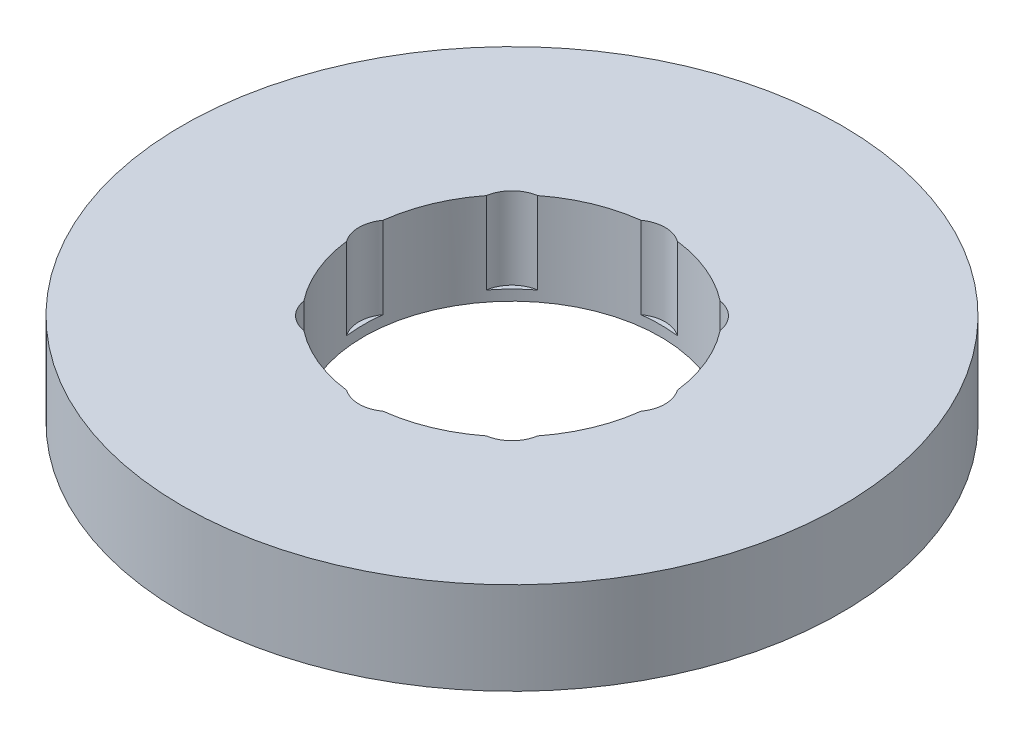
ISO-10303-21;
HEADER;
FILE_DESCRIPTION(('STEP AP214'),'2;1');
FILE_NAME('part.step','',(''),(''),'','','');
FILE_SCHEMA(('AUTOMOTIVE_DESIGN { 1 0 10303 214 1 1 1 1 }'));
ENDSEC;
DATA;
#1=APPLICATION_CONTEXT('core data for automotive mechanical design processes');
#2=APPLICATION_PROTOCOL_DEFINITION('international standard','automotive_design',2000,#1);
#3=PRODUCT_CONTEXT('',#1,'mechanical');
#4=PRODUCT('Part','Part','',(#3));
#5=PRODUCT_RELATED_PRODUCT_CATEGORY('part','',(#4));
#6=PRODUCT_DEFINITION_FORMATION('','',#4);
#7=PRODUCT_DEFINITION_CONTEXT('part definition',#1,'design');
#8=PRODUCT_DEFINITION('design','',#6,#7);
#9=PRODUCT_DEFINITION_SHAPE('','',#8);
#10=(LENGTH_UNIT() NAMED_UNIT(*) SI_UNIT(.MILLI.,.METRE.));
#11=(NAMED_UNIT(*) PLANE_ANGLE_UNIT() SI_UNIT($,.RADIAN.));
#12=(NAMED_UNIT(*) SI_UNIT($,.STERADIAN.) SOLID_ANGLE_UNIT());
#13=UNCERTAINTY_MEASURE_WITH_UNIT(LENGTH_MEASURE(1.E-05),#10,'distance_accuracy_value','');
#14=(GEOMETRIC_REPRESENTATION_CONTEXT(3) GLOBAL_UNCERTAINTY_ASSIGNED_CONTEXT((#13)) GLOBAL_UNIT_ASSIGNED_CONTEXT((#10,
#11,#12)) REPRESENTATION_CONTEXT('',''));
#15=CARTESIAN_POINT('',(0.,0.,0.));
#16=DIRECTION('',(0.,0.,1.));
#17=DIRECTION('',(1.,0.,0.));
#18=AXIS2_PLACEMENT_3D('',#15,#16,#17);
#19=CARTESIAN_POINT('',(0.,28.,0.));
#20=DIRECTION('',(0.,-1.,0.));
#21=DIRECTION('',(0.,0.,-1.));
#22=AXIS2_PLACEMENT_3D('',#19,#20,#21);
#23=CYLINDRICAL_SURFACE('',#22,100.);
#24=CARTESIAN_POINT('',(0.,28.,0.));
#25=DIRECTION('',(0.,1.,0.));
#26=DIRECTION('',(0.,0.,1.));
#27=AXIS2_PLACEMENT_3D('',#24,#25,#26);
#28=CIRCLE('',#27,100.);
#29=CARTESIAN_POINT('',(0.,28.,100.));
#30=VERTEX_POINT('',#29);
#31=EDGE_CURVE('E183',#30,#30,#28,.T.);
#32=ORIENTED_EDGE('',*,*,#31,.F.);
#33=EDGE_LOOP('',(#32));
#34=FACE_BOUND('',#33,.T.);
#35=CARTESIAN_POINT('',(0.,0.,0.));
#36=DIRECTION('',(0.,1.,0.));
#37=DIRECTION('',(0.,0.,1.));
#38=AXIS2_PLACEMENT_3D('',#35,#36,#37);
#39=CIRCLE('',#38,100.);
#40=CARTESIAN_POINT('',(0.,0.,100.));
#41=VERTEX_POINT('',#40);
#42=EDGE_CURVE('E182',#41,#41,#39,.T.);
#43=ORIENTED_EDGE('',*,*,#42,.T.);
#44=EDGE_LOOP('',(#43));
#45=FACE_BOUND('',#44,.T.);
#46=ADVANCED_FACE('F39',(#34,#45),#23,.T.);
#47=CARTESIAN_POINT('',(0.,28.,0.));
#48=DIRECTION('',(0.,1.,0.));
#49=DIRECTION('',(0.,0.,1.));
#50=AXIS2_PLACEMENT_3D('',#47,#48,#49);
#51=PLANE('',#50);
#52=CARTESIAN_POINT('',(1.29324487022736E-13,28.,37.0400052218485));
#53=DIRECTION('',(0.,1.,0.));
#54=DIRECTION('',(1.,0.,0.));
#55=AXIS2_PLACEMENT_3D('',#52,#53,#54);
#56=CIRCLE('',#55,9.40392657882914);
#57=CARTESIAN_POINT('',(-5.50870925722544,28.,44.6615508275223));
#58=VERTEX_POINT('',#57);
#59=CARTESIAN_POINT('',(5.50870925722575,28.,44.6615508275223));
#60=VERTEX_POINT('',#59);
#61=EDGE_CURVE('E256',#58,#60,#56,.T.);
#62=ORIENTED_EDGE('',*,*,#61,.F.);
#63=CARTESIAN_POINT('',(0.,28.,0.));
#64=DIRECTION('',(0.,1.,0.));
#65=DIRECTION('',(0.,0.,1.));
#66=AXIS2_PLACEMENT_3D('',#63,#64,#65);
#67=CIRCLE('',#66,45.);
#68=CARTESIAN_POINT('',(-27.6852397770793,28.,35.4757311198181));
#69=VERTEX_POINT('',#68);
#70=EDGE_CURVE('E175',#69,#58,#67,.T.);
#71=ORIENTED_EDGE('',*,*,#70,.F.);
#72=CARTESIAN_POINT('',(-26.1912388675541,28.,26.1912388675542));
#73=DIRECTION('',(0.,1.,0.));
#74=DIRECTION('',(0.707106781186549,0.,0.707106781186546));
#75=AXIS2_PLACEMENT_3D('',#72,#73,#74);
#76=CIRCLE('',#75,9.40392657882914);
#77=CARTESIAN_POINT('',(-35.475731119818,28.,27.6852397770794));
#78=VERTEX_POINT('',#77);
#79=EDGE_CURVE('E152',#78,#69,#76,.T.);
#80=ORIENTED_EDGE('',*,*,#79,.F.);
#81=CARTESIAN_POINT('',(-44.6615508275223,28.,5.50870925722559));
#82=VERTEX_POINT('',#81);
#83=EDGE_CURVE('E168',#82,#78,#67,.T.);
#84=ORIENTED_EDGE('',*,*,#83,.F.);
#85=CARTESIAN_POINT('',(-37.0400052218485,28.,0.));
#86=DIRECTION('',(0.,1.,0.));
#87=DIRECTION('',(0.,0.,1.));
#88=AXIS2_PLACEMENT_3D('',#85,#86,#87);
#89=CIRCLE('',#88,9.40392657882914);
#90=CARTESIAN_POINT('',(-44.6615508275223,28.,-5.50870925722559));
#91=VERTEX_POINT('',#90);
#92=EDGE_CURVE('E205',#91,#82,#89,.T.);
#93=ORIENTED_EDGE('',*,*,#92,.F.);
#94=CARTESIAN_POINT('',(-35.4757311198183,28.,-27.6852397770789));
#95=VERTEX_POINT('',#94);
#96=EDGE_CURVE('E181',#95,#91,#67,.T.);
#97=ORIENTED_EDGE('',*,*,#96,.F.);
#98=CARTESIAN_POINT('',(-26.1912388675545,28.,-26.1912388675539));
#99=DIRECTION('',(0.,1.,0.));
#100=DIRECTION('',(-0.707106781186539,0.,0.707106781186556));
#101=AXIS2_PLACEMENT_3D('',#98,#99,#100);
#102=CIRCLE('',#101,9.40392657882914);
#103=CARTESIAN_POINT('',(-27.6852397770798,28.,-35.4757311198177));
#104=VERTEX_POINT('',#103);
#105=EDGE_CURVE('E453',#104,#95,#102,.T.);
#106=ORIENTED_EDGE('',*,*,#105,.F.);
#107=CARTESIAN_POINT('',(-5.50870925722606,28.,-44.6615508275222));
#108=VERTEX_POINT('',#107);
#109=EDGE_CURVE('E189',#108,#104,#67,.T.);
#110=ORIENTED_EDGE('',*,*,#109,.F.);
#111=CARTESIAN_POINT('',(-3.87973461068208E-13,28.,-37.0400052218485));
#112=DIRECTION('',(0.,1.,0.));
#113=DIRECTION('',(-1.,0.,0.));
#114=AXIS2_PLACEMENT_3D('',#111,#112,#113);
#115=CIRCLE('',#114,9.40392657882914);
#116=CARTESIAN_POINT('',(5.50870925722513,28.,-44.6615508275223));
#117=VERTEX_POINT('',#116);
#118=EDGE_CURVE('E462',#117,#108,#115,.T.);
#119=ORIENTED_EDGE('',*,*,#118,.F.);
#120=CARTESIAN_POINT('',(27.685239777079,28.,-35.4757311198182));
#121=VERTEX_POINT('',#120);
#122=EDGE_CURVE('E197',#121,#117,#67,.T.);
#123=ORIENTED_EDGE('',*,*,#122,.F.);
#124=CARTESIAN_POINT('',(26.191238867554,28.,-26.1912388675544));
#125=DIRECTION('',(0.,1.,0.));
#126=DIRECTION('',(-0.707106781186554,0.,-0.707106781186541));
#127=AXIS2_PLACEMENT_3D('',#124,#125,#126);
#128=CIRCLE('',#127,9.40392657882914);
#129=CARTESIAN_POINT('',(35.4757311198178,28.,-27.6852397770797));
#130=VERTEX_POINT('',#129);
#131=EDGE_CURVE('E470',#130,#121,#128,.T.);
#132=ORIENTED_EDGE('',*,*,#131,.F.);
#133=CARTESIAN_POINT('',(44.6615508275223,28.,-5.50870925722559));
#134=VERTEX_POINT('',#133);
#135=EDGE_CURVE('E489',#134,#130,#67,.T.);
#136=ORIENTED_EDGE('',*,*,#135,.F.);
#137=CARTESIAN_POINT('',(37.0400052218485,28.,0.));
#138=DIRECTION('',(0.,1.,0.));
#139=DIRECTION('',(0.,0.,-1.));
#140=AXIS2_PLACEMENT_3D('',#137,#138,#139);
#141=CIRCLE('',#140,9.40392657882914);
#142=CARTESIAN_POINT('',(44.6615508275223,28.,5.50870925722559));
#143=VERTEX_POINT('',#142);
#144=EDGE_CURVE('E476',#143,#134,#141,.T.);
#145=ORIENTED_EDGE('',*,*,#144,.F.);
#146=CARTESIAN_POINT('',(35.4757311198181,28.,27.6852397770792));
#147=VERTEX_POINT('',#146);
#148=EDGE_CURVE('E491',#147,#143,#67,.T.);
#149=ORIENTED_EDGE('',*,*,#148,.F.);
#150=CARTESIAN_POINT('',(26.1912388675543,28.,26.191238867554));
#151=DIRECTION('',(0.,1.,0.));
#152=DIRECTION('',(0.707106781186544,0.,-0.707106781186551));
#153=AXIS2_PLACEMENT_3D('',#150,#151,#152);
#154=CIRCLE('',#153,9.40392657882914);
#155=CARTESIAN_POINT('',(27.6852397770795,28.,35.4757311198179));
#156=VERTEX_POINT('',#155);
#157=EDGE_CURVE('E475',#156,#147,#154,.T.);
#158=ORIENTED_EDGE('',*,*,#157,.F.);
#159=EDGE_CURVE('E190',#60,#156,#67,.T.);
#160=ORIENTED_EDGE('',*,*,#159,.F.);
#161=EDGE_LOOP('',(#62,#71,#80,#84,#93,#97,#106,#110,#119,#123,#132,#136,#145,#149,#158,#160));
#162=FACE_BOUND('',#161,.T.);
#163=ORIENTED_EDGE('',*,*,#31,.T.);
#164=EDGE_LOOP('',(#163));
#165=FACE_BOUND('',#164,.T.);
#166=ADVANCED_FACE('F170',(#162,#165),#51,.T.);
#167=CARTESIAN_POINT('',(0.,0.,0.));
#168=DIRECTION('',(0.,1.,0.));
#169=DIRECTION('',(0.,0.,1.));
#170=AXIS2_PLACEMENT_3D('',#167,#168,#169);
#171=PLANE('',#170);
#172=CARTESIAN_POINT('',(0.,0.,0.));
#173=DIRECTION('',(0.,1.,0.));
#174=DIRECTION('',(0.,0.,1.));
#175=AXIS2_PLACEMENT_3D('',#172,#173,#174);
#176=CIRCLE('',#175,45.);
#177=CARTESIAN_POINT('',(0.,0.,45.));
#178=VERTEX_POINT('',#177);
#179=EDGE_CURVE('E191',#178,#178,#176,.T.);
#180=ORIENTED_EDGE('',*,*,#179,.T.);
#181=EDGE_LOOP('',(#180));
#182=FACE_BOUND('',#181,.T.);
#183=ORIENTED_EDGE('',*,*,#42,.F.);
#184=EDGE_LOOP('',(#183));
#185=FACE_BOUND('',#184,.T.);
#186=ADVANCED_FACE('F277',(#182,#185),#171,.F.);
#187=CARTESIAN_POINT('',(0.,28.,0.));
#188=DIRECTION('',(0.,-1.,0.));
#189=DIRECTION('',(0.,0.,-1.));
#190=AXIS2_PLACEMENT_3D('',#187,#188,#189);
#191=CYLINDRICAL_SURFACE('',#190,45.);
#192=DIRECTION('',(0.,1.,0.));
#193=VECTOR('',#192,1.);
#194=CARTESIAN_POINT('',(-5.50870925722543,15.5942397780652,44.6615508275223));
#195=LINE('',#194,#193);
#196=CARTESIAN_POINT('',(-5.50870925722544,3.1884795561304,44.6615508275223));
#197=VERTEX_POINT('',#196);
#198=EDGE_CURVE('E11',#197,#58,#195,.T.);
#199=ORIENTED_EDGE('',*,*,#198,.F.);
#200=CARTESIAN_POINT('',(0.,3.1884795561304,0.));
#201=DIRECTION('',(0.,1.,0.));
#202=DIRECTION('',(0.,0.,1.));
#203=AXIS2_PLACEMENT_3D('',#200,#201,#202);
#204=CIRCLE('',#203,45.);
#205=CARTESIAN_POINT('',(5.50870925722575,3.1884795561304,44.6615508275223));
#206=VERTEX_POINT('',#205);
#207=EDGE_CURVE('E251',#197,#206,#204,.T.);
#208=ORIENTED_EDGE('',*,*,#207,.T.);
#209=DIRECTION('',(0.,1.,0.));
#210=VECTOR('',#209,1.);
#211=CARTESIAN_POINT('',(5.50870925722574,15.5942397780652,44.6615508275223));
#212=LINE('',#211,#210);
#213=EDGE_CURVE('E46',#60,#206,#212,.F.);
#214=ORIENTED_EDGE('',*,*,#213,.F.);
#215=ORIENTED_EDGE('',*,*,#159,.T.);
#216=DIRECTION('',(0.,1.,0.));
#217=VECTOR('',#216,1.);
#218=CARTESIAN_POINT('',(27.6852397770796,15.5942397780652,35.4757311198179));
#219=LINE('',#218,#217);
#220=CARTESIAN_POINT('',(27.6852397770795,3.1884795561304,35.4757311198179));
#221=VERTEX_POINT('',#220);
#222=EDGE_CURVE('E253',#221,#156,#219,.T.);
#223=ORIENTED_EDGE('',*,*,#222,.F.);
#224=CARTESIAN_POINT('',(0.,3.1884795561304,0.));
#225=DIRECTION('',(0.,1.,0.));
#226=DIRECTION('',(0.,0.,1.));
#227=AXIS2_PLACEMENT_3D('',#224,#225,#226);
#228=CIRCLE('',#227,45.);
#229=CARTESIAN_POINT('',(35.4757311198181,3.1884795561304,27.6852397770792));
#230=VERTEX_POINT('',#229);
#231=EDGE_CURVE('E246',#221,#230,#228,.T.);
#232=ORIENTED_EDGE('',*,*,#231,.T.);
#233=DIRECTION('',(0.,1.,0.));
#234=VECTOR('',#233,1.);
#235=CARTESIAN_POINT('',(35.4757311198181,15.5942397780652,27.6852397770792));
#236=LINE('',#235,#234);
#237=EDGE_CURVE('E248',#147,#230,#236,.F.);
#238=ORIENTED_EDGE('',*,*,#237,.F.);
#239=ORIENTED_EDGE('',*,*,#148,.T.);
#240=DIRECTION('',(0.,1.,0.));
#241=VECTOR('',#240,1.);
#242=CARTESIAN_POINT('',(44.6615508275223,15.5942397780652,5.50870925722558));
#243=LINE('',#242,#241);
#244=CARTESIAN_POINT('',(44.6615508275223,3.1884795561304,5.50870925722559));
#245=VERTEX_POINT('',#244);
#246=EDGE_CURVE('E243',#245,#143,#243,.T.);
#247=ORIENTED_EDGE('',*,*,#246,.F.);
#248=CARTESIAN_POINT('',(0.,3.1884795561304,0.));
#249=DIRECTION('',(0.,1.,0.));
#250=DIRECTION('',(0.,0.,1.));
#251=AXIS2_PLACEMENT_3D('',#248,#249,#250);
#252=CIRCLE('',#251,45.);
#253=CARTESIAN_POINT('',(44.6615508275223,3.1884795561304,-5.50870925722559));
#254=VERTEX_POINT('',#253);
#255=EDGE_CURVE('E236',#245,#254,#252,.T.);
#256=ORIENTED_EDGE('',*,*,#255,.T.);
#257=DIRECTION('',(0.,1.,0.));
#258=VECTOR('',#257,1.);
#259=CARTESIAN_POINT('',(44.6615508275223,15.5942397780652,-5.50870925722558));
#260=LINE('',#259,#258);
#261=EDGE_CURVE('E241',#134,#254,#260,.F.);
#262=ORIENTED_EDGE('',*,*,#261,.F.);
#263=ORIENTED_EDGE('',*,*,#135,.T.);
#264=DIRECTION('',(0.,1.,0.));
#265=VECTOR('',#264,1.);
#266=CARTESIAN_POINT('',(35.4757311198178,15.5942397780652,-27.6852397770797));
#267=LINE('',#266,#265);
#268=CARTESIAN_POINT('',(35.4757311198178,3.1884795561304,-27.6852397770797));
#269=VERTEX_POINT('',#268);
#270=EDGE_CURVE('E237',#269,#130,#267,.T.);
#271=ORIENTED_EDGE('',*,*,#270,.F.);
#272=CARTESIAN_POINT('',(0.,3.1884795561304,0.));
#273=DIRECTION('',(0.,1.,0.));
#274=DIRECTION('',(0.,0.,1.));
#275=AXIS2_PLACEMENT_3D('',#272,#273,#274);
#276=CIRCLE('',#275,45.);
#277=CARTESIAN_POINT('',(27.685239777079,3.1884795561304,-35.4757311198182));
#278=VERTEX_POINT('',#277);
#279=EDGE_CURVE('E229',#269,#278,#276,.T.);
#280=ORIENTED_EDGE('',*,*,#279,.T.);
#281=DIRECTION('',(0.,1.,0.));
#282=VECTOR('',#281,1.);
#283=CARTESIAN_POINT('',(27.6852397770791,15.5942397780652,-35.4757311198182));
#284=LINE('',#283,#282);
#285=EDGE_CURVE('E232',#121,#278,#284,.F.);
#286=ORIENTED_EDGE('',*,*,#285,.F.);
#287=ORIENTED_EDGE('',*,*,#122,.T.);
#288=DIRECTION('',(0.,1.,0.));
#289=VECTOR('',#288,1.);
#290=CARTESIAN_POINT('',(5.50870925722512,15.5942397780652,-44.6615508275224));
#291=LINE('',#290,#289);
#292=CARTESIAN_POINT('',(5.50870925722513,3.1884795561304,-44.6615508275223));
#293=VERTEX_POINT('',#292);
#294=EDGE_CURVE('E227',#293,#117,#291,.T.);
#295=ORIENTED_EDGE('',*,*,#294,.F.);
#296=CARTESIAN_POINT('',(0.,3.1884795561304,0.));
#297=DIRECTION('',(0.,1.,0.));
#298=DIRECTION('',(0.,0.,1.));
#299=AXIS2_PLACEMENT_3D('',#296,#297,#298);
#300=CIRCLE('',#299,45.);
#301=CARTESIAN_POINT('',(-5.50870925722606,3.1884795561304,-44.6615508275222));
#302=VERTEX_POINT('',#301);
#303=EDGE_CURVE('E225',#293,#302,#300,.T.);
#304=ORIENTED_EDGE('',*,*,#303,.T.);
#305=DIRECTION('',(0.,1.,0.));
#306=VECTOR('',#305,1.);
#307=CARTESIAN_POINT('',(-5.50870925722605,15.5942397780652,-44.6615508275222));
#308=LINE('',#307,#306);
#309=EDGE_CURVE('E223',#108,#302,#308,.F.);
#310=ORIENTED_EDGE('',*,*,#309,.F.);
#311=ORIENTED_EDGE('',*,*,#109,.T.);
#312=DIRECTION('',(0.,1.,0.));
#313=VECTOR('',#312,1.);
#314=CARTESIAN_POINT('',(-27.6852397770798,15.5942397780652,-35.4757311198177));
#315=LINE('',#314,#313);
#316=CARTESIAN_POINT('',(-27.6852397770798,3.1884795561304,-35.4757311198177));
#317=VERTEX_POINT('',#316);
#318=EDGE_CURVE('E219',#317,#104,#315,.T.);
#319=ORIENTED_EDGE('',*,*,#318,.F.);
#320=CARTESIAN_POINT('',(0.,3.1884795561304,0.));
#321=DIRECTION('',(0.,1.,0.));
#322=DIRECTION('',(0.,0.,1.));
#323=AXIS2_PLACEMENT_3D('',#320,#321,#322);
#324=CIRCLE('',#323,45.);
#325=CARTESIAN_POINT('',(-35.4757311198183,3.1884795561304,-27.6852397770789));
#326=VERTEX_POINT('',#325);
#327=EDGE_CURVE('E159',#317,#326,#324,.T.);
#328=ORIENTED_EDGE('',*,*,#327,.T.);
#329=DIRECTION('',(0.,1.,0.));
#330=VECTOR('',#329,1.);
#331=CARTESIAN_POINT('',(-35.4757311198183,15.5942397780652,-27.6852397770789));
#332=LINE('',#331,#330);
#333=EDGE_CURVE('E220',#95,#326,#332,.F.);
#334=ORIENTED_EDGE('',*,*,#333,.F.);
#335=ORIENTED_EDGE('',*,*,#96,.T.);
#336=DIRECTION('',(0.,1.,0.));
#337=VECTOR('',#336,1.);
#338=CARTESIAN_POINT('',(-44.6615508275223,15.5942397780652,-5.50870925722558));
#339=LINE('',#338,#337);
#340=CARTESIAN_POINT('',(-44.6615508275223,3.1884795561304,-5.50870925722559));
#341=VERTEX_POINT('',#340);
#342=EDGE_CURVE('E209',#341,#91,#339,.T.);
#343=ORIENTED_EDGE('',*,*,#342,.F.);
#344=CARTESIAN_POINT('',(0.,3.1884795561304,0.));
#345=DIRECTION('',(0.,1.,0.));
#346=DIRECTION('',(0.,0.,1.));
#347=AXIS2_PLACEMENT_3D('',#344,#345,#346);
#348=CIRCLE('',#347,45.);
#349=CARTESIAN_POINT('',(-44.6615508275223,3.1884795561304,5.50870925722559));
#350=VERTEX_POINT('',#349);
#351=EDGE_CURVE('E206',#341,#350,#348,.T.);
#352=ORIENTED_EDGE('',*,*,#351,.T.);
#353=DIRECTION('',(0.,1.,0.));
#354=VECTOR('',#353,1.);
#355=CARTESIAN_POINT('',(-44.6615508275223,15.5942397780652,5.50870925722558));
#356=LINE('',#355,#354);
#357=EDGE_CURVE('E179',#82,#350,#356,.F.);
#358=ORIENTED_EDGE('',*,*,#357,.F.);
#359=ORIENTED_EDGE('',*,*,#83,.T.);
#360=DIRECTION('',(0.,1.,0.));
#361=VECTOR('',#360,1.);
#362=CARTESIAN_POINT('',(-35.475731119818,15.5942397780652,27.6852397770794));
#363=LINE('',#362,#361);
#364=CARTESIAN_POINT('',(-35.475731119818,3.1884795561304,27.6852397770794));
#365=VERTEX_POINT('',#364);
#366=EDGE_CURVE('E147',#365,#78,#363,.T.);
#367=ORIENTED_EDGE('',*,*,#366,.F.);
#368=CARTESIAN_POINT('',(0.,3.1884795561304,0.));
#369=DIRECTION('',(0.,1.,0.));
#370=DIRECTION('',(0.,0.,1.));
#371=AXIS2_PLACEMENT_3D('',#368,#369,#370);
#372=CIRCLE('',#371,45.);
#373=CARTESIAN_POINT('',(-27.6852397770793,3.1884795561304,35.4757311198181));
#374=VERTEX_POINT('',#373);
#375=EDGE_CURVE('E215',#365,#374,#372,.T.);
#376=ORIENTED_EDGE('',*,*,#375,.T.);
#377=DIRECTION('',(0.,1.,0.));
#378=VECTOR('',#377,1.);
#379=CARTESIAN_POINT('',(-27.6852397770793,15.5942397780652,35.4757311198181));
#380=LINE('',#379,#378);
#381=EDGE_CURVE('E161',#69,#374,#380,.F.);
#382=ORIENTED_EDGE('',*,*,#381,.F.);
#383=ORIENTED_EDGE('',*,*,#70,.T.);
#384=EDGE_LOOP('',(#199,#208,#214,#215,#223,#232,#238,#239,#247,#256,#262,#263,#271,#280,#286,
#287,#295,#304,#310,#311,#319,#328,#334,#335,#343,#352,#358,#359,#367,#376,#382,#383));
#385=FACE_BOUND('',#384,.T.);
#386=ORIENTED_EDGE('',*,*,#179,.F.);
#387=EDGE_LOOP('',(#386));
#388=FACE_BOUND('',#387,.T.);
#389=ADVANCED_FACE('F176',(#385,#388),#191,.F.);
#390=CARTESIAN_POINT('',(-37.0400052218485,3.1884795561304,0.));
#391=DIRECTION('',(0.,1.,0.));
#392=DIRECTION('',(0.,0.,1.));
#393=AXIS2_PLACEMENT_3D('',#390,#391,#392);
#394=CYLINDRICAL_SURFACE('',#393,9.40392657882914);
#395=ORIENTED_EDGE('',*,*,#342,.T.);
#396=ORIENTED_EDGE('',*,*,#92,.T.);
#397=ORIENTED_EDGE('',*,*,#357,.T.);
#398=CARTESIAN_POINT('',(-37.0400052218485,3.1884795561304,0.));
#399=DIRECTION('',(0.,1.,0.));
#400=DIRECTION('',(0.,0.,1.));
#401=AXIS2_PLACEMENT_3D('',#398,#399,#400);
#402=CIRCLE('',#401,9.40392657882914);
#403=EDGE_CURVE('E200',#341,#350,#402,.T.);
#404=ORIENTED_EDGE('',*,*,#403,.F.);
#405=EDGE_LOOP('',(#395,#396,#397,#404));
#406=FACE_BOUND('',#405,.T.);
#407=ADVANCED_FACE('F286',(#406),#394,.F.);
#408=CARTESIAN_POINT('',(-37.0400052218485,3.1884795561304,0.));
#409=DIRECTION('',(0.,1.,0.));
#410=DIRECTION('',(0.,0.,1.));
#411=AXIS2_PLACEMENT_3D('',#408,#409,#410);
#412=PLANE('',#411);
#413=ORIENTED_EDGE('',*,*,#403,.T.);
#414=ORIENTED_EDGE('',*,*,#351,.F.);
#415=EDGE_LOOP('',(#413,#414));
#416=FACE_BOUND('',#415,.T.);
#417=ADVANCED_FACE('F289',(#416),#412,.T.);
#418=CARTESIAN_POINT('',(-26.1912388675541,3.1884795561304,26.1912388675542));
#419=DIRECTION('',(0.,1.,0.));
#420=DIRECTION('',(0.,0.,1.));
#421=AXIS2_PLACEMENT_3D('',#418,#419,#420);
#422=CYLINDRICAL_SURFACE('',#421,9.40392657882914);
#423=ORIENTED_EDGE('',*,*,#366,.T.);
#424=ORIENTED_EDGE('',*,*,#79,.T.);
#425=ORIENTED_EDGE('',*,*,#381,.T.);
#426=CARTESIAN_POINT('',(-26.1912388675541,3.1884795561304,26.1912388675542));
#427=DIRECTION('',(0.,1.,0.));
#428=DIRECTION('',(0.707106781186549,0.,0.707106781186546));
#429=AXIS2_PLACEMENT_3D('',#426,#427,#428);
#430=CIRCLE('',#429,9.40392657882914);
#431=EDGE_CURVE('E156',#365,#374,#430,.T.);
#432=ORIENTED_EDGE('',*,*,#431,.F.);
#433=EDGE_LOOP('',(#423,#424,#425,#432));
#434=FACE_BOUND('',#433,.T.);
#435=ADVANCED_FACE('F155',(#434),#422,.F.);
#436=CARTESIAN_POINT('',(-26.1912388675541,3.1884795561304,26.1912388675542));
#437=DIRECTION('',(0.,1.,0.));
#438=DIRECTION('',(0.707106781186549,0.,0.707106781186546));
#439=AXIS2_PLACEMENT_3D('',#436,#437,#438);
#440=PLANE('',#439);
#441=ORIENTED_EDGE('',*,*,#431,.T.);
#442=ORIENTED_EDGE('',*,*,#375,.F.);
#443=EDGE_LOOP('',(#441,#442));
#444=FACE_BOUND('',#443,.T.);
#445=ADVANCED_FACE('F300',(#444),#440,.T.);
#446=CARTESIAN_POINT('',(-26.1912388675545,3.1884795561304,-26.1912388675539));
#447=DIRECTION('',(0.,1.,0.));
#448=DIRECTION('',(0.,0.,1.));
#449=AXIS2_PLACEMENT_3D('',#446,#447,#448);
#450=CYLINDRICAL_SURFACE('',#449,9.40392657882914);
#451=ORIENTED_EDGE('',*,*,#318,.T.);
#452=ORIENTED_EDGE('',*,*,#105,.T.);
#453=ORIENTED_EDGE('',*,*,#333,.T.);
#454=CARTESIAN_POINT('',(-26.1912388675545,3.1884795561304,-26.1912388675539));
#455=DIRECTION('',(0.,1.,0.));
#456=DIRECTION('',(-0.707106781186539,0.,0.707106781186556));
#457=AXIS2_PLACEMENT_3D('',#454,#455,#456);
#458=CIRCLE('',#457,9.40392657882914);
#459=EDGE_CURVE('E454',#317,#326,#458,.T.);
#460=ORIENTED_EDGE('',*,*,#459,.F.);
#461=EDGE_LOOP('',(#451,#452,#453,#460));
#462=FACE_BOUND('',#461,.T.);
#463=ADVANCED_FACE('F299',(#462),#450,.F.);
#464=CARTESIAN_POINT('',(-26.1912388675545,3.1884795561304,-26.1912388675539));
#465=DIRECTION('',(0.,1.,0.));
#466=DIRECTION('',(-0.707106781186539,0.,0.707106781186556));
#467=AXIS2_PLACEMENT_3D('',#464,#465,#466);
#468=PLANE('',#467);
#469=ORIENTED_EDGE('',*,*,#459,.T.);
#470=ORIENTED_EDGE('',*,*,#327,.F.);
#471=EDGE_LOOP('',(#469,#470));
#472=FACE_BOUND('',#471,.T.);
#473=ADVANCED_FACE('F379',(#472),#468,.T.);
#474=CARTESIAN_POINT('',(-3.87973461068208E-13,3.1884795561304,-37.0400052218485));
#475=DIRECTION('',(0.,1.,0.));
#476=DIRECTION('',(0.,0.,1.));
#477=AXIS2_PLACEMENT_3D('',#474,#475,#476);
#478=CYLINDRICAL_SURFACE('',#477,9.40392657882914);
#479=ORIENTED_EDGE('',*,*,#294,.T.);
#480=ORIENTED_EDGE('',*,*,#118,.T.);
#481=ORIENTED_EDGE('',*,*,#309,.T.);
#482=CARTESIAN_POINT('',(-3.87973461068208E-13,3.1884795561304,-37.0400052218485));
#483=DIRECTION('',(0.,1.,0.));
#484=DIRECTION('',(-1.,0.,0.));
#485=AXIS2_PLACEMENT_3D('',#482,#483,#484);
#486=CIRCLE('',#485,9.40392657882914);
#487=EDGE_CURVE('E465',#293,#302,#486,.T.);
#488=ORIENTED_EDGE('',*,*,#487,.F.);
#489=EDGE_LOOP('',(#479,#480,#481,#488));
#490=FACE_BOUND('',#489,.T.);
#491=ADVANCED_FACE('F371',(#490),#478,.F.);
#492=CARTESIAN_POINT('',(-3.87973461068208E-13,3.1884795561304,-37.0400052218485));
#493=DIRECTION('',(0.,1.,0.));
#494=DIRECTION('',(-1.,0.,0.));
#495=AXIS2_PLACEMENT_3D('',#492,#493,#494);
#496=PLANE('',#495);
#497=ORIENTED_EDGE('',*,*,#487,.T.);
#498=ORIENTED_EDGE('',*,*,#303,.F.);
#499=EDGE_LOOP('',(#497,#498));
#500=FACE_BOUND('',#499,.T.);
#501=ADVANCED_FACE('F308',(#500),#496,.T.);
#502=CARTESIAN_POINT('',(26.191238867554,3.1884795561304,-26.1912388675544));
#503=DIRECTION('',(0.,1.,0.));
#504=DIRECTION('',(0.,0.,1.));
#505=AXIS2_PLACEMENT_3D('',#502,#503,#504);
#506=CYLINDRICAL_SURFACE('',#505,9.40392657882914);
#507=ORIENTED_EDGE('',*,*,#270,.T.);
#508=ORIENTED_EDGE('',*,*,#131,.T.);
#509=ORIENTED_EDGE('',*,*,#285,.T.);
#510=CARTESIAN_POINT('',(26.191238867554,3.1884795561304,-26.1912388675544));
#511=DIRECTION('',(0.,1.,0.));
#512=DIRECTION('',(-0.707106781186554,0.,-0.707106781186541));
#513=AXIS2_PLACEMENT_3D('',#510,#511,#512);
#514=CIRCLE('',#513,9.40392657882914);
#515=EDGE_CURVE('E477',#269,#278,#514,.T.);
#516=ORIENTED_EDGE('',*,*,#515,.F.);
#517=EDGE_LOOP('',(#507,#508,#509,#516));
#518=FACE_BOUND('',#517,.T.);
#519=ADVANCED_FACE('F305',(#518),#506,.F.);
#520=CARTESIAN_POINT('',(26.191238867554,3.1884795561304,-26.1912388675544));
#521=DIRECTION('',(0.,1.,0.));
#522=DIRECTION('',(-0.707106781186554,0.,-0.707106781186541));
#523=AXIS2_PLACEMENT_3D('',#520,#521,#522);
#524=PLANE('',#523);
#525=ORIENTED_EDGE('',*,*,#515,.T.);
#526=ORIENTED_EDGE('',*,*,#279,.F.);
#527=EDGE_LOOP('',(#525,#526));
#528=FACE_BOUND('',#527,.T.);
#529=ADVANCED_FACE('F304',(#528),#524,.T.);
#530=CARTESIAN_POINT('',(37.0400052218485,3.1884795561304,0.));
#531=DIRECTION('',(0.,1.,0.));
#532=DIRECTION('',(0.,0.,1.));
#533=AXIS2_PLACEMENT_3D('',#530,#531,#532);
#534=CYLINDRICAL_SURFACE('',#533,9.40392657882914);
#535=ORIENTED_EDGE('',*,*,#246,.T.);
#536=ORIENTED_EDGE('',*,*,#144,.T.);
#537=ORIENTED_EDGE('',*,*,#261,.T.);
#538=CARTESIAN_POINT('',(37.0400052218485,3.1884795561304,0.));
#539=DIRECTION('',(0.,1.,0.));
#540=DIRECTION('',(0.,0.,-1.));
#541=AXIS2_PLACEMENT_3D('',#538,#539,#540);
#542=CIRCLE('',#541,9.40392657882914);
#543=EDGE_CURVE('E478',#245,#254,#542,.T.);
#544=ORIENTED_EDGE('',*,*,#543,.F.);
#545=EDGE_LOOP('',(#535,#536,#537,#544));
#546=FACE_BOUND('',#545,.T.);
#547=ADVANCED_FACE('F309',(#546),#534,.F.);
#548=CARTESIAN_POINT('',(37.0400052218485,3.1884795561304,0.));
#549=DIRECTION('',(0.,1.,0.));
#550=DIRECTION('',(0.,0.,-1.));
#551=AXIS2_PLACEMENT_3D('',#548,#549,#550);
#552=PLANE('',#551);
#553=ORIENTED_EDGE('',*,*,#543,.T.);
#554=ORIENTED_EDGE('',*,*,#255,.F.);
#555=EDGE_LOOP('',(#553,#554));
#556=FACE_BOUND('',#555,.T.);
#557=ADVANCED_FACE('F314',(#556),#552,.T.);
#558=CARTESIAN_POINT('',(26.1912388675543,3.1884795561304,26.191238867554));
#559=DIRECTION('',(0.,1.,0.));
#560=DIRECTION('',(0.,0.,1.));
#561=AXIS2_PLACEMENT_3D('',#558,#559,#560);
#562=CYLINDRICAL_SURFACE('',#561,9.40392657882914);
#563=ORIENTED_EDGE('',*,*,#222,.T.);
#564=ORIENTED_EDGE('',*,*,#157,.T.);
#565=ORIENTED_EDGE('',*,*,#237,.T.);
#566=CARTESIAN_POINT('',(26.1912388675543,3.1884795561304,26.191238867554));
#567=DIRECTION('',(0.,1.,0.));
#568=DIRECTION('',(0.707106781186544,0.,-0.707106781186551));
#569=AXIS2_PLACEMENT_3D('',#566,#567,#568);
#570=CIRCLE('',#569,9.40392657882914);
#571=EDGE_CURVE('E56',#221,#230,#570,.T.);
#572=ORIENTED_EDGE('',*,*,#571,.F.);
#573=EDGE_LOOP('',(#563,#564,#565,#572));
#574=FACE_BOUND('',#573,.T.);
#575=ADVANCED_FACE('F318',(#574),#562,.F.);
#576=CARTESIAN_POINT('',(26.1912388675543,3.1884795561304,26.191238867554));
#577=DIRECTION('',(0.,1.,0.));
#578=DIRECTION('',(0.707106781186544,0.,-0.707106781186551));
#579=AXIS2_PLACEMENT_3D('',#576,#577,#578);
#580=PLANE('',#579);
#581=ORIENTED_EDGE('',*,*,#571,.T.);
#582=ORIENTED_EDGE('',*,*,#231,.F.);
#583=EDGE_LOOP('',(#581,#582));
#584=FACE_BOUND('',#583,.T.);
#585=ADVANCED_FACE('F270',(#584),#580,.T.);
#586=CARTESIAN_POINT('',(1.29324487022736E-13,3.1884795561304,37.0400052218485));
#587=DIRECTION('',(0.,1.,0.));
#588=DIRECTION('',(0.,0.,1.));
#589=AXIS2_PLACEMENT_3D('',#586,#587,#588);
#590=CYLINDRICAL_SURFACE('',#589,9.40392657882914);
#591=ORIENTED_EDGE('',*,*,#198,.T.);
#592=ORIENTED_EDGE('',*,*,#61,.T.);
#593=ORIENTED_EDGE('',*,*,#213,.T.);
#594=CARTESIAN_POINT('',(1.29324487022736E-13,3.1884795561304,37.0400052218485));
#595=DIRECTION('',(0.,1.,0.));
#596=DIRECTION('',(1.,0.,0.));
#597=AXIS2_PLACEMENT_3D('',#594,#595,#596);
#598=CIRCLE('',#597,9.40392657882914);
#599=EDGE_CURVE('E55',#197,#206,#598,.T.);
#600=ORIENTED_EDGE('',*,*,#599,.F.);
#601=EDGE_LOOP('',(#591,#592,#593,#600));
#602=FACE_BOUND('',#601,.T.);
#603=ADVANCED_FACE('F260',(#602),#590,.F.);
#604=CARTESIAN_POINT('',(1.29324487022736E-13,3.1884795561304,37.0400052218485));
#605=DIRECTION('',(0.,1.,0.));
#606=DIRECTION('',(1.,0.,0.));
#607=AXIS2_PLACEMENT_3D('',#604,#605,#606);
#608=PLANE('',#607);
#609=ORIENTED_EDGE('',*,*,#599,.T.);
#610=ORIENTED_EDGE('',*,*,#207,.F.);
#611=EDGE_LOOP('',(#609,#610));
#612=FACE_BOUND('',#611,.T.);
#613=ADVANCED_FACE('F261',(#612),#608,.T.);
#614=CLOSED_SHELL('',(#46,#166,#186,#389,#407,#417,#435,#445,#463,#473,#491,#501,#519,#529,#547,
#557,#575,#585,#603,#613));
#615=MANIFOLD_SOLID_BREP('B2',#614);
#616=ADVANCED_BREP_SHAPE_REPRESENTATION('',(#18,#615),#14);
#617=SHAPE_DEFINITION_REPRESENTATION(#9,#616);
ENDSEC;
END-ISO-10303-21;
